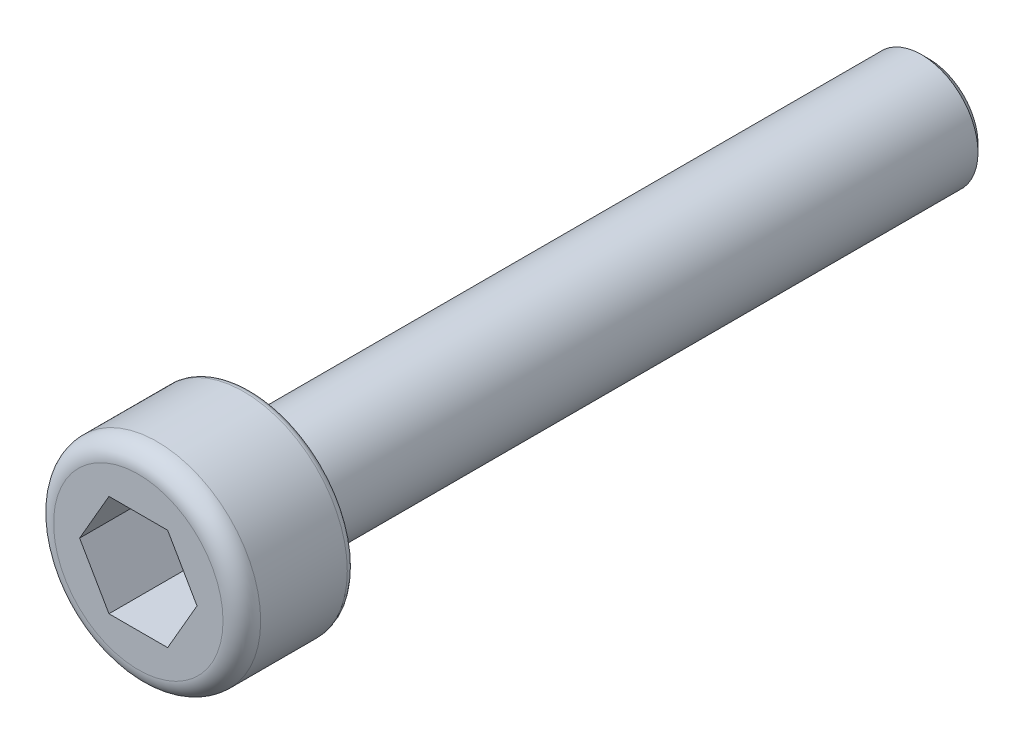
ISO-10303-21;
HEADER;
FILE_DESCRIPTION(('STEP AP214'),'2;1');
FILE_NAME('part.step','',(''),(''),'','','');
FILE_SCHEMA(('AUTOMOTIVE_DESIGN { 1 0 10303 214 1 1 1 1 }'));
ENDSEC;
DATA;
#1=APPLICATION_CONTEXT('core data for automotive mechanical design processes');
#2=APPLICATION_PROTOCOL_DEFINITION('international standard','automotive_design',2000,#1);
#3=PRODUCT_CONTEXT('',#1,'mechanical');
#4=PRODUCT('Part','Part','',(#3));
#5=PRODUCT_RELATED_PRODUCT_CATEGORY('part','',(#4));
#6=PRODUCT_DEFINITION_FORMATION('','',#4);
#7=PRODUCT_DEFINITION_CONTEXT('part definition',#1,'design');
#8=PRODUCT_DEFINITION('design','',#6,#7);
#9=PRODUCT_DEFINITION_SHAPE('','',#8);
#10=(LENGTH_UNIT() NAMED_UNIT(*) SI_UNIT(.MILLI.,.METRE.));
#11=(NAMED_UNIT(*) PLANE_ANGLE_UNIT() SI_UNIT($,.RADIAN.));
#12=(NAMED_UNIT(*) SI_UNIT($,.STERADIAN.) SOLID_ANGLE_UNIT());
#13=UNCERTAINTY_MEASURE_WITH_UNIT(LENGTH_MEASURE(1.E-05),#10,'distance_accuracy_value','');
#14=(GEOMETRIC_REPRESENTATION_CONTEXT(3) GLOBAL_UNCERTAINTY_ASSIGNED_CONTEXT((#13)) GLOBAL_UNIT_ASSIGNED_CONTEXT((#10,
#11,#12)) REPRESENTATION_CONTEXT('',''));
#15=CARTESIAN_POINT('',(0.,0.,0.));
#16=DIRECTION('',(0.,0.,1.));
#17=DIRECTION('',(1.,0.,0.));
#18=AXIS2_PLACEMENT_3D('',#15,#16,#17);
#19=CARTESIAN_POINT('',(0.,0.,0.));
#20=DIRECTION('',(0.,0.,1.));
#21=DIRECTION('',(1.,0.,0.));
#22=AXIS2_PLACEMENT_3D('',#19,#20,#21);
#23=PLANE('',#22);
#24=CARTESIAN_POINT('',(0.,0.,0.));
#25=DIRECTION('',(0.,0.,1.));
#26=DIRECTION('',(1.,0.,0.));
#27=AXIS2_PLACEMENT_3D('',#24,#25,#26);
#28=CIRCLE('',#27,2.55);
#29=CARTESIAN_POINT('',(2.55,0.,0.));
#30=VERTEX_POINT('',#29);
#31=EDGE_CURVE('E11',#30,#30,#28,.F.);
#32=ORIENTED_EDGE('',*,*,#31,.T.);
#33=EDGE_LOOP('',(#32));
#34=FACE_BOUND('',#33,.T.);
#35=CARTESIAN_POINT('',(0.,0.,0.));
#36=DIRECTION('',(0.,0.,1.));
#37=DIRECTION('',(1.,0.,0.));
#38=AXIS2_PLACEMENT_3D('',#35,#36,#37);
#39=CIRCLE('',#38,1.5);
#40=CARTESIAN_POINT('',(1.5,0.,0.));
#41=VERTEX_POINT('',#40);
#42=EDGE_CURVE('E151',#41,#41,#39,.F.);
#43=ORIENTED_EDGE('',*,*,#42,.F.);
#44=EDGE_LOOP('',(#43));
#45=FACE_BOUND('',#44,.T.);
#46=ADVANCED_FACE('F38',(#34,#45),#23,.F.);
#47=CARTESIAN_POINT('',(0.,0.,3.));
#48=DIRECTION('',(0.,0.,-1.));
#49=DIRECTION('',(-1.,0.,0.));
#50=AXIS2_PLACEMENT_3D('',#47,#48,#49);
#51=CYLINDRICAL_SURFACE('',#50,2.75);
#52=CARTESIAN_POINT('',(0.,0.,0.2));
#53=DIRECTION('',(0.,0.,1.));
#54=DIRECTION('',(1.,0.,0.));
#55=AXIS2_PLACEMENT_3D('',#52,#53,#54);
#56=CIRCLE('',#55,2.75);
#57=CARTESIAN_POINT('',(2.75,0.,0.2));
#58=VERTEX_POINT('',#57);
#59=EDGE_CURVE('E46',#58,#58,#56,.T.);
#60=ORIENTED_EDGE('',*,*,#59,.T.);
#61=EDGE_LOOP('',(#60));
#62=FACE_BOUND('',#61,.T.);
#63=CARTESIAN_POINT('',(0.,0.,2.5));
#64=DIRECTION('',(0.,0.,1.));
#65=DIRECTION('',(1.,0.,0.));
#66=AXIS2_PLACEMENT_3D('',#63,#64,#65);
#67=CIRCLE('',#66,2.75);
#68=CARTESIAN_POINT('',(2.75,0.,2.5));
#69=VERTEX_POINT('',#68);
#70=EDGE_CURVE('E148',#69,#69,#67,.F.);
#71=ORIENTED_EDGE('',*,*,#70,.T.);
#72=EDGE_LOOP('',(#71));
#73=FACE_BOUND('',#72,.T.);
#74=ADVANCED_FACE('F162',(#62,#73),#51,.T.);
#75=CARTESIAN_POINT('',(0.,0.,3.));
#76=DIRECTION('',(0.,0.,1.));
#77=DIRECTION('',(1.,0.,0.));
#78=AXIS2_PLACEMENT_3D('',#75,#76,#77);
#79=PLANE('',#78);
#80=DIRECTION('',(0.5,0.866025403784439,0.));
#81=VECTOR('',#80,1.);
#82=CARTESIAN_POINT('',(0.779422863405995,-1.35,3.));
#83=LINE('',#82,#81);
#84=CARTESIAN_POINT('',(0.779422863405995,-1.35,3.));
#85=VERTEX_POINT('',#84);
#86=CARTESIAN_POINT('',(1.55884572681199,0.,3.));
#87=VERTEX_POINT('',#86);
#88=EDGE_CURVE('E53',#85,#87,#83,.T.);
#89=ORIENTED_EDGE('',*,*,#88,.F.);
#90=DIRECTION('',(1.,0.,0.));
#91=VECTOR('',#90,1.);
#92=CARTESIAN_POINT('',(-0.779422863405994,-1.35,3.));
#93=LINE('',#92,#91);
#94=CARTESIAN_POINT('',(-0.779422863405994,-1.35,3.));
#95=VERTEX_POINT('',#94);
#96=EDGE_CURVE('E136',#95,#85,#93,.T.);
#97=ORIENTED_EDGE('',*,*,#96,.F.);
#98=DIRECTION('',(0.5,-0.866025403784438,0.));
#99=VECTOR('',#98,1.);
#100=CARTESIAN_POINT('',(-1.55884572681199,0.,3.));
#101=LINE('',#100,#99);
#102=CARTESIAN_POINT('',(-1.55884572681199,0.,3.));
#103=VERTEX_POINT('',#102);
#104=EDGE_CURVE('E134',#103,#95,#101,.T.);
#105=ORIENTED_EDGE('',*,*,#104,.F.);
#106=DIRECTION('',(-0.5,-0.866025403784438,0.));
#107=VECTOR('',#106,1.);
#108=CARTESIAN_POINT('',(-0.779422863405995,1.35,3.));
#109=LINE('',#108,#107);
#110=CARTESIAN_POINT('',(-0.779422863405995,1.35,3.));
#111=VERTEX_POINT('',#110);
#112=EDGE_CURVE('E101',#111,#103,#109,.T.);
#113=ORIENTED_EDGE('',*,*,#112,.F.);
#114=DIRECTION('',(-1.,0.,0.));
#115=VECTOR('',#114,1.);
#116=CARTESIAN_POINT('',(0.779422863405994,1.35,3.));
#117=LINE('',#116,#115);
#118=CARTESIAN_POINT('',(0.779422863405994,1.35,3.));
#119=VERTEX_POINT('',#118);
#120=EDGE_CURVE('E130',#119,#111,#117,.T.);
#121=ORIENTED_EDGE('',*,*,#120,.F.);
#122=DIRECTION('',(-0.5,0.866025403784438,0.));
#123=VECTOR('',#122,1.);
#124=CARTESIAN_POINT('',(1.55884572681199,0.,3.));
#125=LINE('',#124,#123);
#126=EDGE_CURVE('E127',#87,#119,#125,.T.);
#127=ORIENTED_EDGE('',*,*,#126,.F.);
#128=EDGE_LOOP('',(#89,#97,#105,#113,#121,#127));
#129=FACE_BOUND('',#128,.T.);
#130=CARTESIAN_POINT('',(0.,0.,3.));
#131=DIRECTION('',(0.,0.,1.));
#132=DIRECTION('',(1.,0.,0.));
#133=AXIS2_PLACEMENT_3D('',#130,#131,#132);
#134=CIRCLE('',#133,2.25);
#135=CARTESIAN_POINT('',(2.25,0.,3.));
#136=VERTEX_POINT('',#135);
#137=EDGE_CURVE('E140',#136,#136,#134,.T.);
#138=ORIENTED_EDGE('',*,*,#137,.T.);
#139=EDGE_LOOP('',(#138));
#140=FACE_BOUND('',#139,.T.);
#141=ADVANCED_FACE('F180',(#129,#140),#79,.T.);
#142=CARTESIAN_POINT('',(0.,0.,2.5));
#143=DIRECTION('',(0.,0.,1.));
#144=DIRECTION('',(1.,0.,0.));
#145=AXIS2_PLACEMENT_3D('',#142,#143,#144);
#146=TOROIDAL_SURFACE('',#145,2.25,0.5);
#147=ORIENTED_EDGE('',*,*,#70,.F.);
#148=EDGE_LOOP('',(#147));
#149=FACE_BOUND('',#148,.T.);
#150=ORIENTED_EDGE('',*,*,#137,.F.);
#151=EDGE_LOOP('',(#150));
#152=FACE_BOUND('',#151,.T.);
#153=ADVANCED_FACE('F186',(#149,#152),#146,.T.);
#154=CARTESIAN_POINT('',(0.779422863405995,-1.35,1.));
#155=DIRECTION('',(0.866025403784439,-0.5,0.));
#156=DIRECTION('',(0.5,0.866025403784439,0.));
#157=AXIS2_PLACEMENT_3D('',#154,#155,#156);
#158=PLANE('',#157);
#159=ORIENTED_EDGE('',*,*,#88,.T.);
#160=DIRECTION('',(0.,0.,1.));
#161=VECTOR('',#160,1.);
#162=CARTESIAN_POINT('',(1.55884572681199,0.,1.));
#163=LINE('',#162,#161);
#164=CARTESIAN_POINT('',(1.55884572681199,0.,1.));
#165=VERTEX_POINT('',#164);
#166=EDGE_CURVE('E83',#165,#87,#163,.T.);
#167=ORIENTED_EDGE('',*,*,#166,.F.);
#168=DIRECTION('',(0.5,0.866025403784439,0.));
#169=VECTOR('',#168,1.);
#170=CARTESIAN_POINT('',(0.779422863405995,-1.35,1.));
#171=LINE('',#170,#169);
#172=CARTESIAN_POINT('',(0.779422863405995,-1.35,1.));
#173=VERTEX_POINT('',#172);
#174=EDGE_CURVE('E138',#173,#165,#171,.T.);
#175=ORIENTED_EDGE('',*,*,#174,.F.);
#176=DIRECTION('',(0.,0.,1.));
#177=VECTOR('',#176,1.);
#178=CARTESIAN_POINT('',(0.779422863405995,-1.35,1.));
#179=LINE('',#178,#177);
#180=EDGE_CURVE('E61',#173,#85,#179,.T.);
#181=ORIENTED_EDGE('',*,*,#180,.T.);
#182=EDGE_LOOP('',(#159,#167,#175,#181));
#183=FACE_BOUND('',#182,.T.);
#184=ADVANCED_FACE('F188',(#183),#158,.F.);
#185=CARTESIAN_POINT('',(-0.779422863405994,-1.35,1.));
#186=DIRECTION('',(0.,-1.,0.));
#187=DIRECTION('',(0.,0.,-1.));
#188=AXIS2_PLACEMENT_3D('',#185,#186,#187);
#189=PLANE('',#188);
#190=ORIENTED_EDGE('',*,*,#96,.T.);
#191=ORIENTED_EDGE('',*,*,#180,.F.);
#192=DIRECTION('',(1.,0.,0.));
#193=VECTOR('',#192,1.);
#194=CARTESIAN_POINT('',(-0.779422863405994,-1.35,1.));
#195=LINE('',#194,#193);
#196=CARTESIAN_POINT('',(-0.779422863405994,-1.35,1.));
#197=VERTEX_POINT('',#196);
#198=EDGE_CURVE('E113',#197,#173,#195,.T.);
#199=ORIENTED_EDGE('',*,*,#198,.F.);
#200=DIRECTION('',(0.,0.,1.));
#201=VECTOR('',#200,1.);
#202=CARTESIAN_POINT('',(-0.779422863405994,-1.35,1.));
#203=LINE('',#202,#201);
#204=EDGE_CURVE('E105',#197,#95,#203,.T.);
#205=ORIENTED_EDGE('',*,*,#204,.T.);
#206=EDGE_LOOP('',(#190,#191,#199,#205));
#207=FACE_BOUND('',#206,.T.);
#208=ADVANCED_FACE('F194',(#207),#189,.F.);
#209=CARTESIAN_POINT('',(-1.55884572681199,0.,1.));
#210=DIRECTION('',(-0.866025403784438,-0.5,0.));
#211=DIRECTION('',(0.5,-0.866025403784438,0.));
#212=AXIS2_PLACEMENT_3D('',#209,#210,#211);
#213=PLANE('',#212);
#214=ORIENTED_EDGE('',*,*,#104,.T.);
#215=ORIENTED_EDGE('',*,*,#204,.F.);
#216=DIRECTION('',(0.5,-0.866025403784438,0.));
#217=VECTOR('',#216,1.);
#218=CARTESIAN_POINT('',(-1.55884572681199,0.,1.));
#219=LINE('',#218,#217);
#220=CARTESIAN_POINT('',(-1.55884572681199,0.,1.));
#221=VERTEX_POINT('',#220);
#222=EDGE_CURVE('E109',#221,#197,#219,.T.);
#223=ORIENTED_EDGE('',*,*,#222,.F.);
#224=DIRECTION('',(0.,0.,1.));
#225=VECTOR('',#224,1.);
#226=CARTESIAN_POINT('',(-1.55884572681199,0.,1.));
#227=LINE('',#226,#225);
#228=EDGE_CURVE('E94',#221,#103,#227,.T.);
#229=ORIENTED_EDGE('',*,*,#228,.T.);
#230=EDGE_LOOP('',(#214,#215,#223,#229));
#231=FACE_BOUND('',#230,.T.);
#232=ADVANCED_FACE('F110',(#231),#213,.F.);
#233=CARTESIAN_POINT('',(-0.779422863405995,1.35,1.));
#234=DIRECTION('',(-0.866025403784439,0.5,0.));
#235=DIRECTION('',(-0.5,-0.866025403784439,0.));
#236=AXIS2_PLACEMENT_3D('',#233,#234,#235);
#237=PLANE('',#236);
#238=ORIENTED_EDGE('',*,*,#112,.T.);
#239=ORIENTED_EDGE('',*,*,#228,.F.);
#240=DIRECTION('',(-0.5,-0.866025403784438,0.));
#241=VECTOR('',#240,1.);
#242=CARTESIAN_POINT('',(-0.779422863405995,1.35,1.));
#243=LINE('',#242,#241);
#244=CARTESIAN_POINT('',(-0.779422863405995,1.35,1.));
#245=VERTEX_POINT('',#244);
#246=EDGE_CURVE('E98',#245,#221,#243,.T.);
#247=ORIENTED_EDGE('',*,*,#246,.F.);
#248=DIRECTION('',(0.,0.,1.));
#249=VECTOR('',#248,1.);
#250=CARTESIAN_POINT('',(-0.779422863405995,1.35,1.));
#251=LINE('',#250,#249);
#252=EDGE_CURVE('E106',#245,#111,#251,.T.);
#253=ORIENTED_EDGE('',*,*,#252,.T.);
#254=EDGE_LOOP('',(#238,#239,#247,#253));
#255=FACE_BOUND('',#254,.T.);
#256=ADVANCED_FACE('F96',(#255),#237,.F.);
#257=CARTESIAN_POINT('',(0.779422863405994,1.35,1.));
#258=DIRECTION('',(0.,1.,0.));
#259=DIRECTION('',(0.,0.,1.));
#260=AXIS2_PLACEMENT_3D('',#257,#258,#259);
#261=PLANE('',#260);
#262=ORIENTED_EDGE('',*,*,#120,.T.);
#263=ORIENTED_EDGE('',*,*,#252,.F.);
#264=DIRECTION('',(-1.,0.,0.));
#265=VECTOR('',#264,1.);
#266=CARTESIAN_POINT('',(0.779422863405994,1.35,1.));
#267=LINE('',#266,#265);
#268=CARTESIAN_POINT('',(0.779422863405994,1.35,1.));
#269=VERTEX_POINT('',#268);
#270=EDGE_CURVE('E119',#269,#245,#267,.T.);
#271=ORIENTED_EDGE('',*,*,#270,.F.);
#272=DIRECTION('',(0.,0.,1.));
#273=VECTOR('',#272,1.);
#274=CARTESIAN_POINT('',(0.779422863405994,1.35,1.));
#275=LINE('',#274,#273);
#276=EDGE_CURVE('E143',#269,#119,#275,.T.);
#277=ORIENTED_EDGE('',*,*,#276,.T.);
#278=EDGE_LOOP('',(#262,#263,#271,#277));
#279=FACE_BOUND('',#278,.T.);
#280=ADVANCED_FACE('F219',(#279),#261,.F.);
#281=CARTESIAN_POINT('',(1.55884572681199,0.,1.));
#282=DIRECTION('',(0.866025403784438,0.5,0.));
#283=DIRECTION('',(-0.5,0.866025403784438,0.));
#284=AXIS2_PLACEMENT_3D('',#281,#282,#283);
#285=PLANE('',#284);
#286=ORIENTED_EDGE('',*,*,#126,.T.);
#287=ORIENTED_EDGE('',*,*,#276,.F.);
#288=DIRECTION('',(-0.5,0.866025403784438,0.));
#289=VECTOR('',#288,1.);
#290=CARTESIAN_POINT('',(1.55884572681199,0.,1.));
#291=LINE('',#290,#289);
#292=EDGE_CURVE('E121',#165,#269,#291,.T.);
#293=ORIENTED_EDGE('',*,*,#292,.F.);
#294=ORIENTED_EDGE('',*,*,#166,.T.);
#295=EDGE_LOOP('',(#286,#287,#293,#294));
#296=FACE_BOUND('',#295,.T.);
#297=ADVANCED_FACE('F206',(#296),#285,.F.);
#298=CARTESIAN_POINT('',(0.,0.,1.));
#299=DIRECTION('',(0.,0.,1.));
#300=DIRECTION('',(1.,0.,0.));
#301=AXIS2_PLACEMENT_3D('',#298,#299,#300);
#302=PLANE('',#301);
#303=ORIENTED_EDGE('',*,*,#174,.T.);
#304=ORIENTED_EDGE('',*,*,#292,.T.);
#305=ORIENTED_EDGE('',*,*,#270,.T.);
#306=ORIENTED_EDGE('',*,*,#246,.T.);
#307=ORIENTED_EDGE('',*,*,#222,.T.);
#308=ORIENTED_EDGE('',*,*,#198,.T.);
#309=EDGE_LOOP('',(#303,#304,#305,#306,#307,#308));
#310=FACE_BOUND('',#309,.T.);
#311=ADVANCED_FACE('F116',(#310),#302,.T.);
#312=CARTESIAN_POINT('',(0.,0.,-18.));
#313=DIRECTION('',(0.,0.,1.));
#314=DIRECTION('',(1.,0.,0.));
#315=AXIS2_PLACEMENT_3D('',#312,#313,#314);
#316=CYLINDRICAL_SURFACE('',#315,1.5);
#317=CARTESIAN_POINT('',(0.,0.,-17.8));
#318=DIRECTION('',(0.,0.,-1.));
#319=DIRECTION('',(-1.,0.,0.));
#320=AXIS2_PLACEMENT_3D('',#317,#318,#319);
#321=CIRCLE('',#320,1.5);
#322=CARTESIAN_POINT('',(-1.5,0.,-17.8));
#323=VERTEX_POINT('',#322);
#324=EDGE_CURVE('E157',#323,#323,#321,.F.);
#325=ORIENTED_EDGE('',*,*,#324,.T.);
#326=EDGE_LOOP('',(#325));
#327=FACE_BOUND('',#326,.T.);
#328=ORIENTED_EDGE('',*,*,#42,.T.);
#329=EDGE_LOOP('',(#328));
#330=FACE_BOUND('',#329,.T.);
#331=ADVANCED_FACE('F227',(#327,#330),#316,.T.);
#332=CARTESIAN_POINT('',(0.,0.,-18.));
#333=DIRECTION('',(0.,0.,-1.));
#334=DIRECTION('',(-1.,0.,0.));
#335=AXIS2_PLACEMENT_3D('',#332,#333,#334);
#336=PLANE('',#335);
#337=CARTESIAN_POINT('',(0.,0.,-18.));
#338=DIRECTION('',(0.,0.,-1.));
#339=DIRECTION('',(-1.,0.,0.));
#340=AXIS2_PLACEMENT_3D('',#337,#338,#339);
#341=CIRCLE('',#340,1.30000000000001);
#342=CARTESIAN_POINT('',(-1.30000000000001,0.,-18.));
#343=VERTEX_POINT('',#342);
#344=EDGE_CURVE('E154',#343,#343,#341,.T.);
#345=ORIENTED_EDGE('',*,*,#344,.T.);
#346=EDGE_LOOP('',(#345));
#347=FACE_BOUND('',#346,.T.);
#348=ADVANCED_FACE('F171',(#347),#336,.T.);
#349=CARTESIAN_POINT('',(0.,0.,-18.));
#350=DIRECTION('',(0.,0.,1.));
#351=DIRECTION('',(1.,0.,0.));
#352=AXIS2_PLACEMENT_3D('',#349,#350,#351);
#353=CONICAL_SURFACE('',#352,1.30000000000001,0.785398163397446);
#354=ORIENTED_EDGE('',*,*,#324,.F.);
#355=EDGE_LOOP('',(#354));
#356=FACE_BOUND('',#355,.T.);
#357=ORIENTED_EDGE('',*,*,#344,.F.);
#358=EDGE_LOOP('',(#357));
#359=FACE_BOUND('',#358,.T.);
#360=ADVANCED_FACE('F166',(#356,#359),#353,.T.);
#361=CARTESIAN_POINT('',(0.,0.,0.2));
#362=DIRECTION('',(0.,0.,1.));
#363=DIRECTION('',(1.,0.,0.));
#364=AXIS2_PLACEMENT_3D('',#361,#362,#363);
#365=TOROIDAL_SURFACE('',#364,2.55,0.2);
#366=ORIENTED_EDGE('',*,*,#31,.F.);
#367=EDGE_LOOP('',(#366));
#368=FACE_BOUND('',#367,.T.);
#369=ORIENTED_EDGE('',*,*,#59,.F.);
#370=EDGE_LOOP('',(#369));
#371=FACE_BOUND('',#370,.T.);
#372=ADVANCED_FACE('F40',(#368,#371),#365,.T.);
#373=CLOSED_SHELL('',(#46,#74,#141,#153,#184,#208,#232,#256,#280,#297,#311,#331,#348,#360,#372));
#374=MANIFOLD_SOLID_BREP('B2',#373);
#375=ADVANCED_BREP_SHAPE_REPRESENTATION('',(#18,#374),#14);
#376=SHAPE_DEFINITION_REPRESENTATION(#9,#375);
ENDSEC;
END-ISO-10303-21;
